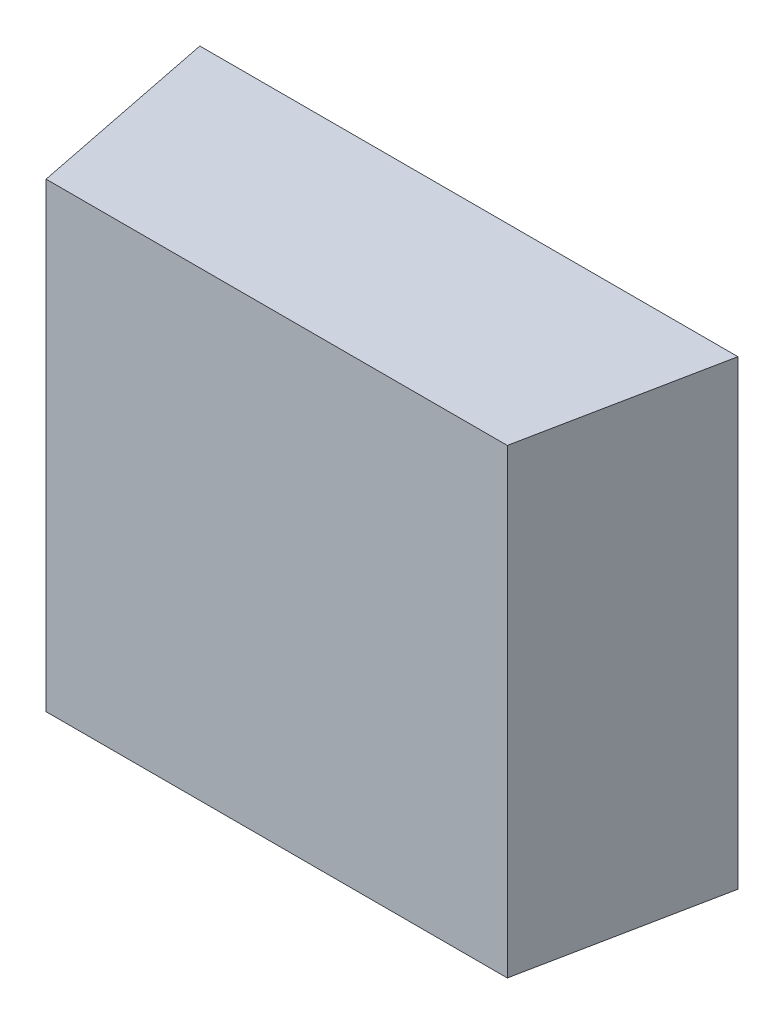
ISO-10303-21;
HEADER;
FILE_DESCRIPTION(('STEP AP214'),'2;1');
FILE_NAME('part.step','',(''),(''),'','','');
FILE_SCHEMA(('AUTOMOTIVE_DESIGN { 1 0 10303 214 1 1 1 1 }'));
ENDSEC;
DATA;
#1=APPLICATION_CONTEXT('core data for automotive mechanical design processes');
#2=APPLICATION_PROTOCOL_DEFINITION('international standard','automotive_design',2000,#1);
#3=PRODUCT_CONTEXT('',#1,'mechanical');
#4=PRODUCT('Part','Part','',(#3));
#5=PRODUCT_RELATED_PRODUCT_CATEGORY('part','',(#4));
#6=PRODUCT_DEFINITION_FORMATION('','',#4);
#7=PRODUCT_DEFINITION_CONTEXT('part definition',#1,'design');
#8=PRODUCT_DEFINITION('design','',#6,#7);
#9=PRODUCT_DEFINITION_SHAPE('','',#8);
#10=(LENGTH_UNIT() NAMED_UNIT(*) SI_UNIT(.MILLI.,.METRE.));
#11=(NAMED_UNIT(*) PLANE_ANGLE_UNIT() SI_UNIT($,.RADIAN.));
#12=(NAMED_UNIT(*) SI_UNIT($,.STERADIAN.) SOLID_ANGLE_UNIT());
#13=UNCERTAINTY_MEASURE_WITH_UNIT(LENGTH_MEASURE(1.E-05),#10,'distance_accuracy_value','');
#14=(GEOMETRIC_REPRESENTATION_CONTEXT(3) GLOBAL_UNCERTAINTY_ASSIGNED_CONTEXT((#13)) GLOBAL_UNIT_ASSIGNED_CONTEXT((#10,
#11,#12)) REPRESENTATION_CONTEXT('',''));
#15=CARTESIAN_POINT('',(0.,0.,0.));
#16=DIRECTION('',(0.,0.,1.));
#17=DIRECTION('',(1.,0.,0.));
#18=AXIS2_PLACEMENT_3D('',#15,#16,#17);
#19=CARTESIAN_POINT('',(-0.766485678621241,-0.927979057558617,0.0911708661417334));
#20=DIRECTION('',(0.,0.,-1.));
#21=DIRECTION('',(-1.,0.,0.));
#22=AXIS2_PLACEMENT_3D('',#19,#20,#21);
#23=PLANE('',#22);
#24=DIRECTION('',(0.,1.,0.));
#25=VECTOR('',#24,1.);
#26=CARTESIAN_POINT('',(-0.764525048699981,-0.927979057558617,0.0911708661417335));
#27=LINE('',#26,#25);
#28=CARTESIAN_POINT('',(-0.764525048699981,-0.929939687479877,0.0911708661417334));
#29=VERTEX_POINT('',#28);
#30=CARTESIAN_POINT('',(-0.764525048699981,-0.969152285905073,0.0911708661417334));
#31=VERTEX_POINT('',#30);
#32=EDGE_CURVE('E20',#29,#31,#27,.F.);
#33=ORIENTED_EDGE('',*,*,#32,.T.);
#34=DIRECTION('',(1.,0.,0.));
#35=VECTOR('',#34,1.);
#36=CARTESIAN_POINT('',(-0.770080166810218,-0.969152285905073,0.0911708661417334));
#37=LINE('',#36,#35);
#38=CARTESIAN_POINT('',(-0.725312450274785,-0.969152285905073,0.0911708661417334));
#39=VERTEX_POINT('',#38);
#40=EDGE_CURVE('E55',#39,#31,#37,.F.);
#41=ORIENTED_EDGE('',*,*,#40,.F.);
#42=DIRECTION('',(0.,1.,0.));
#43=VECTOR('',#42,1.);
#44=CARTESIAN_POINT('',(-0.725312450274784,-0.927979057558617,0.0911708661417335));
#45=LINE('',#44,#43);
#46=CARTESIAN_POINT('',(-0.725312450274785,-0.929939687479877,0.0911708661417335));
#47=VERTEX_POINT('',#46);
#48=EDGE_CURVE('E76',#39,#47,#45,.T.);
#49=ORIENTED_EDGE('',*,*,#48,.T.);
#50=DIRECTION('',(1.,0.,0.));
#51=VECTOR('',#50,1.);
#52=CARTESIAN_POINT('',(-0.770080166810218,-0.929939687479877,0.0911708661417334));
#53=LINE('',#52,#51);
#54=EDGE_CURVE('E58',#47,#29,#53,.F.);
#55=ORIENTED_EDGE('',*,*,#54,.T.);
#56=EDGE_LOOP('',(#33,#41,#49,#55));
#57=FACE_BOUND('',#56,.T.);
#58=ADVANCED_FACE('F17',(#57),#23,.F.);
#59=CARTESIAN_POINT('',(-0.767956151062186,-0.927979057558617,0.0740153543307098));
#60=DIRECTION('',(0.980580675690921,0.,-0.196116135138182));
#61=DIRECTION('',(-0.196116135138182,0.,-0.980580675690921));
#62=AXIS2_PLACEMENT_3D('',#59,#60,#61);
#63=PLANE('',#62);
#64=DIRECTION('',(0.,1.,0.));
#65=VECTOR('',#64,1.);
#66=CARTESIAN_POINT('',(-0.767792765235415,-0.927979057558617,0.0748322834645681));
#67=LINE('',#66,#65);
#68=CARTESIAN_POINT('',(-0.767792765235415,-0.929939687479877,0.0748322834645681));
#69=VERTEX_POINT('',#68);
#70=CARTESIAN_POINT('',(-0.767792765235415,-0.969152285905073,0.0748322834645681));
#71=VERTEX_POINT('',#70);
#72=EDGE_CURVE('E73',#69,#71,#67,.F.);
#73=ORIENTED_EDGE('',*,*,#72,.T.);
#74=DIRECTION('',(-0.196116135138239,0.,-0.980580675690909));
#75=VECTOR('',#74,1.);
#76=CARTESIAN_POINT('',(-0.764525048699981,-0.969152285905073,0.0911708661417334));
#77=LINE('',#76,#75);
#78=EDGE_CURVE('E63',#31,#71,#77,.T.);
#79=ORIENTED_EDGE('',*,*,#78,.F.);
#80=ORIENTED_EDGE('',*,*,#32,.F.);
#81=DIRECTION('',(-0.196116135138239,0.,-0.980580675690909));
#82=VECTOR('',#81,1.);
#83=CARTESIAN_POINT('',(-0.764525048699981,-0.929939687479877,0.0911708661417334));
#84=LINE('',#83,#82);
#85=EDGE_CURVE('E80',#29,#69,#84,.T.);
#86=ORIENTED_EDGE('',*,*,#85,.T.);
#87=EDGE_LOOP('',(#73,#79,#80,#86));
#88=FACE_BOUND('',#87,.T.);
#89=ADVANCED_FACE('F72',(#88),#63,.F.);
#90=CARTESIAN_POINT('',(-0.770080166810218,-0.969152285905073,0.0740153543307098));
#91=DIRECTION('',(0.,-1.,0.));
#92=DIRECTION('',(1.,0.,0.));
#93=AXIS2_PLACEMENT_3D('',#90,#91,#92);
#94=PLANE('',#93);
#95=DIRECTION('',(-0.196116135138182,0.,0.980580675690921));
#96=VECTOR('',#95,1.);
#97=CARTESIAN_POINT('',(-0.725475836101556,-0.969152285905073,0.0919877952755917));
#98=LINE('',#97,#96);
#99=CARTESIAN_POINT('',(-0.722044733739351,-0.969152285905073,0.0748322834645681));
#100=VERTEX_POINT('',#99);
#101=EDGE_CURVE('E69',#100,#39,#98,.T.);
#102=ORIENTED_EDGE('',*,*,#101,.T.);
#103=ORIENTED_EDGE('',*,*,#40,.T.);
#104=ORIENTED_EDGE('',*,*,#78,.T.);
#105=DIRECTION('',(1.,0.,0.));
#106=VECTOR('',#105,1.);
#107=CARTESIAN_POINT('',(-0.719757332164548,-0.969152285905073,0.0748322834645681));
#108=LINE('',#107,#106);
#109=EDGE_CURVE('E83',#71,#100,#108,.T.);
#110=ORIENTED_EDGE('',*,*,#109,.T.);
#111=EDGE_LOOP('',(#102,#103,#104,#110));
#112=FACE_BOUND('',#111,.T.);
#113=ADVANCED_FACE('F66',(#112),#94,.T.);
#114=CARTESIAN_POINT('',(-0.725475836101556,-0.927979057558617,0.0919877952755917));
#115=DIRECTION('',(-0.980580675690921,0.,-0.196116135138182));
#116=DIRECTION('',(-0.196116135138182,0.,0.980580675690921));
#117=AXIS2_PLACEMENT_3D('',#114,#115,#116);
#118=PLANE('',#117);
#119=ORIENTED_EDGE('',*,*,#48,.F.);
#120=ORIENTED_EDGE('',*,*,#101,.F.);
#121=DIRECTION('',(0.,1.,0.));
#122=VECTOR('',#121,1.);
#123=CARTESIAN_POINT('',(-0.722044733739351,-0.927979057558617,0.0748322834645681));
#124=LINE('',#123,#122);
#125=CARTESIAN_POINT('',(-0.722044733739351,-0.929939687479877,0.0748322834645681));
#126=VERTEX_POINT('',#125);
#127=EDGE_CURVE('E26',#100,#126,#124,.T.);
#128=ORIENTED_EDGE('',*,*,#127,.T.);
#129=DIRECTION('',(-0.196116135138239,0.,0.980580675690909));
#130=VECTOR('',#129,1.);
#131=CARTESIAN_POINT('',(-0.722044733739351,-0.929939687479877,0.0748322834645681));
#132=LINE('',#131,#130);
#133=EDGE_CURVE('E34',#126,#47,#132,.T.);
#134=ORIENTED_EDGE('',*,*,#133,.T.);
#135=EDGE_LOOP('',(#119,#120,#128,#134));
#136=FACE_BOUND('',#135,.T.);
#137=ADVANCED_FACE('F88',(#136),#118,.F.);
#138=CARTESIAN_POINT('',(-0.770080166810218,-0.929939687479877,0.0740153543307098));
#139=DIRECTION('',(0.,-1.,0.));
#140=DIRECTION('',(1.,0.,0.));
#141=AXIS2_PLACEMENT_3D('',#138,#139,#140);
#142=PLANE('',#141);
#143=ORIENTED_EDGE('',*,*,#54,.F.);
#144=ORIENTED_EDGE('',*,*,#133,.F.);
#145=DIRECTION('',(1.,0.,0.));
#146=VECTOR('',#145,1.);
#147=CARTESIAN_POINT('',(-0.719757332164548,-0.929939687479877,0.0748322834645681));
#148=LINE('',#147,#146);
#149=EDGE_CURVE('E11',#126,#69,#148,.F.);
#150=ORIENTED_EDGE('',*,*,#149,.T.);
#151=ORIENTED_EDGE('',*,*,#85,.F.);
#152=EDGE_LOOP('',(#143,#144,#150,#151));
#153=FACE_BOUND('',#152,.T.);
#154=ADVANCED_FACE('F91',(#153),#142,.F.);
#155=CARTESIAN_POINT('',(-0.719757332164548,-0.927979057558617,0.0748322834645681));
#156=DIRECTION('',(0.,0.,1.));
#157=DIRECTION('',(1.,0.,0.));
#158=AXIS2_PLACEMENT_3D('',#155,#156,#157);
#159=PLANE('',#158);
#160=ORIENTED_EDGE('',*,*,#127,.F.);
#161=ORIENTED_EDGE('',*,*,#109,.F.);
#162=ORIENTED_EDGE('',*,*,#72,.F.);
#163=ORIENTED_EDGE('',*,*,#149,.F.);
#164=EDGE_LOOP('',(#160,#161,#162,#163));
#165=FACE_BOUND('',#164,.T.);
#166=ADVANCED_FACE('F90',(#165),#159,.F.);
#167=CLOSED_SHELL('',(#58,#89,#113,#137,#154,#166));
#168=MANIFOLD_SOLID_BREP('B1',#167);
#169=ADVANCED_BREP_SHAPE_REPRESENTATION('',(#18,#168),#14);
#170=SHAPE_DEFINITION_REPRESENTATION(#9,#169);
ENDSEC;
END-ISO-10303-21;
